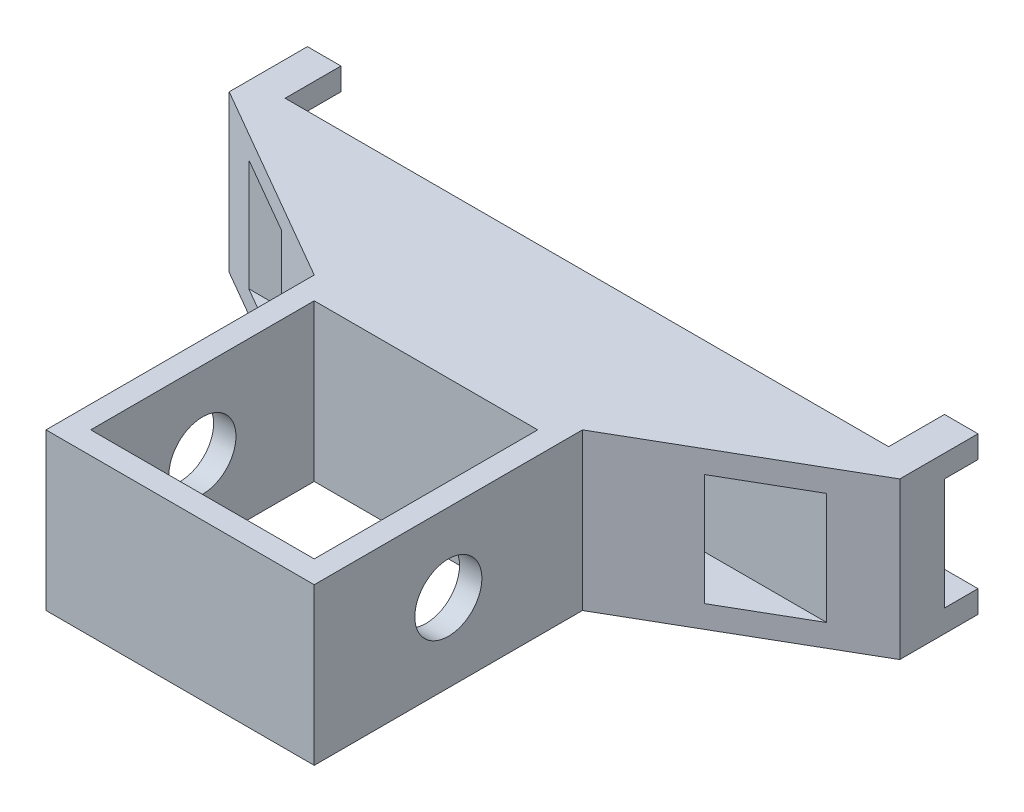
ISO-10303-21;
HEADER;
FILE_DESCRIPTION(('STEP AP214'),'2;1');
FILE_NAME('part.step','',(''),(''),'','','');
FILE_SCHEMA(('AUTOMOTIVE_DESIGN { 1 0 10303 214 1 1 1 1 }'));
ENDSEC;
DATA;
#1=APPLICATION_CONTEXT('core data for automotive mechanical design processes');
#2=APPLICATION_PROTOCOL_DEFINITION('international standard','automotive_design',2000,#1);
#3=PRODUCT_CONTEXT('',#1,'mechanical');
#4=PRODUCT('Part','Part','',(#3));
#5=PRODUCT_RELATED_PRODUCT_CATEGORY('part','',(#4));
#6=PRODUCT_DEFINITION_FORMATION('','',#4);
#7=PRODUCT_DEFINITION_CONTEXT('part definition',#1,'design');
#8=PRODUCT_DEFINITION('design','',#6,#7);
#9=PRODUCT_DEFINITION_SHAPE('','',#8);
#10=(LENGTH_UNIT() NAMED_UNIT(*) SI_UNIT(.MILLI.,.METRE.));
#11=(NAMED_UNIT(*) PLANE_ANGLE_UNIT() SI_UNIT($,.RADIAN.));
#12=(NAMED_UNIT(*) SI_UNIT($,.STERADIAN.) SOLID_ANGLE_UNIT());
#13=UNCERTAINTY_MEASURE_WITH_UNIT(LENGTH_MEASURE(1.E-05),#10,'distance_accuracy_value','');
#14=(GEOMETRIC_REPRESENTATION_CONTEXT(3) GLOBAL_UNCERTAINTY_ASSIGNED_CONTEXT((#13)) GLOBAL_UNIT_ASSIGNED_CONTEXT((#10,
#11,#12)) REPRESENTATION_CONTEXT('',''));
#15=CARTESIAN_POINT('',(0.,0.,0.));
#16=DIRECTION('',(0.,0.,1.));
#17=DIRECTION('',(1.,0.,0.));
#18=AXIS2_PLACEMENT_3D('',#15,#16,#17);
#19=CARTESIAN_POINT('',(0.,7.,-20.6961524227066));
#20=DIRECTION('',(0.,0.,-1.));
#21=DIRECTION('',(-1.,0.,0.));
#22=AXIS2_PLACEMENT_3D('',#19,#20,#21);
#23=PLANE('',#22);
#24=DIRECTION('',(-1.,0.,0.));
#25=VECTOR('',#24,1.);
#26=CARTESIAN_POINT('',(15.,6.,-20.6961524227066));
#27=LINE('',#26,#25);
#28=CARTESIAN_POINT('',(15.,6.,-20.6961524227066));
#29=VERTEX_POINT('',#28);
#30=CARTESIAN_POINT('',(13.5,6.,-20.6961524227066));
#31=VERTEX_POINT('',#30);
#32=EDGE_CURVE('E311',#29,#31,#27,.T.);
#33=ORIENTED_EDGE('',*,*,#32,.T.);
#34=DIRECTION('',(0.,-1.,0.));
#35=VECTOR('',#34,1.);
#36=CARTESIAN_POINT('',(13.5,7.,-20.6961524227066));
#37=LINE('',#36,#35);
#38=CARTESIAN_POINT('',(13.5,7.,-20.6961524227066));
#39=VERTEX_POINT('',#38);
#40=EDGE_CURVE('E360',#39,#31,#37,.T.);
#41=ORIENTED_EDGE('',*,*,#40,.F.);
#42=DIRECTION('',(1.,0.,0.));
#43=VECTOR('',#42,1.);
#44=CARTESIAN_POINT('',(0.,7.,-20.6961524227066));
#45=LINE('',#44,#43);
#46=CARTESIAN_POINT('',(15.,7.,-20.6961524227066));
#47=VERTEX_POINT('',#46);
#48=EDGE_CURVE('E414',#39,#47,#45,.T.);
#49=ORIENTED_EDGE('',*,*,#48,.T.);
#50=DIRECTION('',(0.,-1.,0.));
#51=VECTOR('',#50,1.);
#52=CARTESIAN_POINT('',(15.,7.,-20.6961524227066));
#53=LINE('',#52,#51);
#54=EDGE_CURVE('E247',#47,#29,#53,.T.);
#55=ORIENTED_EDGE('',*,*,#54,.T.);
#56=EDGE_LOOP('',(#33,#41,#49,#55));
#57=FACE_BOUND('',#56,.T.);
#58=ADVANCED_FACE('F39',(#57),#23,.T.);
#59=CARTESIAN_POINT('',(-13.5,6.,-20.6961524227066));
#60=VERTEX_POINT('',#59);
#61=CARTESIAN_POINT('',(-15.,6.,-20.6961524227066));
#62=VERTEX_POINT('',#61);
#63=EDGE_CURVE('E308',#60,#62,#27,.T.);
#64=ORIENTED_EDGE('',*,*,#63,.T.);
#65=DIRECTION('',(0.,-1.,0.));
#66=VECTOR('',#65,1.);
#67=CARTESIAN_POINT('',(-15.,7.,-20.6961524227066));
#68=LINE('',#67,#66);
#69=CARTESIAN_POINT('',(-15.,7.,-20.6961524227066));
#70=VERTEX_POINT('',#69);
#71=EDGE_CURVE('E272',#70,#62,#68,.T.);
#72=ORIENTED_EDGE('',*,*,#71,.F.);
#73=CARTESIAN_POINT('',(-13.5,7.,-20.6961524227067));
#74=VERTEX_POINT('',#73);
#75=EDGE_CURVE('E410',#70,#74,#45,.T.);
#76=ORIENTED_EDGE('',*,*,#75,.T.);
#77=DIRECTION('',(0.,-1.,0.));
#78=VECTOR('',#77,1.);
#79=CARTESIAN_POINT('',(-13.5,7.,-20.6961524227067));
#80=LINE('',#79,#78);
#81=EDGE_CURVE('E363',#74,#60,#80,.T.);
#82=ORIENTED_EDGE('',*,*,#81,.T.);
#83=EDGE_LOOP('',(#64,#72,#76,#82));
#84=FACE_BOUND('',#83,.T.);
#85=ADVANCED_FACE('F509',(#84),#23,.T.);
#86=DIRECTION('',(-1.,0.,0.));
#87=VECTOR('',#86,1.);
#88=CARTESIAN_POINT('',(15.,1.,-20.6961524227066));
#89=LINE('',#88,#87);
#90=CARTESIAN_POINT('',(15.,1.,-20.6961524227066));
#91=VERTEX_POINT('',#90);
#92=CARTESIAN_POINT('',(13.5,1.,-20.6961524227066));
#93=VERTEX_POINT('',#92);
#94=EDGE_CURVE('E54',#91,#93,#89,.T.);
#95=ORIENTED_EDGE('',*,*,#94,.F.);
#96=CARTESIAN_POINT('',(15.,0.,-20.6961524227066));
#97=VERTEX_POINT('',#96);
#98=EDGE_CURVE('E237',#91,#97,#53,.T.);
#99=ORIENTED_EDGE('',*,*,#98,.T.);
#100=DIRECTION('',(1.,0.,0.));
#101=VECTOR('',#100,1.);
#102=CARTESIAN_POINT('',(0.,0.,-20.6961524227066));
#103=LINE('',#102,#101);
#104=CARTESIAN_POINT('',(13.5,0.,-20.6961524227066));
#105=VERTEX_POINT('',#104);
#106=EDGE_CURVE('E403',#105,#97,#103,.T.);
#107=ORIENTED_EDGE('',*,*,#106,.F.);
#108=EDGE_CURVE('E239',#93,#105,#37,.T.);
#109=ORIENTED_EDGE('',*,*,#108,.F.);
#110=EDGE_LOOP('',(#95,#99,#107,#109));
#111=FACE_BOUND('',#110,.T.);
#112=ADVANCED_FACE('F235',(#111),#23,.T.);
#113=CARTESIAN_POINT('',(-13.5,1.,-20.6961524227066));
#114=VERTEX_POINT('',#113);
#115=CARTESIAN_POINT('',(-15.,1.,-20.6961524227066));
#116=VERTEX_POINT('',#115);
#117=EDGE_CURVE('E240',#114,#116,#89,.T.);
#118=ORIENTED_EDGE('',*,*,#117,.F.);
#119=CARTESIAN_POINT('',(-13.5,0.,-20.6961524227067));
#120=VERTEX_POINT('',#119);
#121=EDGE_CURVE('E365',#114,#120,#80,.T.);
#122=ORIENTED_EDGE('',*,*,#121,.T.);
#123=CARTESIAN_POINT('',(-15.,0.,-20.6961524227066));
#124=VERTEX_POINT('',#123);
#125=EDGE_CURVE('E428',#124,#120,#103,.T.);
#126=ORIENTED_EDGE('',*,*,#125,.F.);
#127=EDGE_CURVE('E271',#116,#124,#68,.T.);
#128=ORIENTED_EDGE('',*,*,#127,.F.);
#129=EDGE_LOOP('',(#118,#122,#126,#128));
#130=FACE_BOUND('',#129,.T.);
#131=ADVANCED_FACE('F41',(#130),#23,.T.);
#132=CARTESIAN_POINT('',(-15.,7.,0.));
#133=DIRECTION('',(-1.,0.,0.));
#134=DIRECTION('',(0.,0.,1.));
#135=AXIS2_PLACEMENT_3D('',#132,#133,#134);
#136=PLANE('',#135);
#137=DIRECTION('',(0.,0.,-1.));
#138=VECTOR('',#137,1.);
#139=CARTESIAN_POINT('',(-15.,6.,-20.6961524227066));
#140=LINE('',#139,#138);
#141=CARTESIAN_POINT('',(-15.,6.,-19.1961524227066));
#142=VERTEX_POINT('',#141);
#143=EDGE_CURVE('E231',#142,#62,#140,.T.);
#144=ORIENTED_EDGE('',*,*,#143,.F.);
#145=DIRECTION('',(0.,1.,0.));
#146=VECTOR('',#145,1.);
#147=CARTESIAN_POINT('',(-15.,6.,-19.1961524227066));
#148=LINE('',#147,#146);
#149=CARTESIAN_POINT('',(-15.,1.,-19.1961524227066));
#150=VERTEX_POINT('',#149);
#151=EDGE_CURVE('E302',#150,#142,#148,.T.);
#152=ORIENTED_EDGE('',*,*,#151,.F.);
#153=DIRECTION('',(0.,0.,1.));
#154=VECTOR('',#153,1.);
#155=CARTESIAN_POINT('',(-15.,1.,-20.6961524227066));
#156=LINE('',#155,#154);
#157=EDGE_CURVE('E490',#116,#150,#156,.T.);
#158=ORIENTED_EDGE('',*,*,#157,.F.);
#159=ORIENTED_EDGE('',*,*,#127,.T.);
#160=DIRECTION('',(0.,0.,-1.));
#161=VECTOR('',#160,1.);
#162=CARTESIAN_POINT('',(-15.,0.,0.));
#163=LINE('',#162,#161);
#164=CARTESIAN_POINT('',(-15.,0.,-17.1961524227066));
#165=VERTEX_POINT('',#164);
#166=EDGE_CURVE('E431',#165,#124,#163,.T.);
#167=ORIENTED_EDGE('',*,*,#166,.F.);
#168=DIRECTION('',(0.,-1.,0.));
#169=VECTOR('',#168,1.);
#170=CARTESIAN_POINT('',(-15.,7.,-17.1961524227066));
#171=LINE('',#170,#169);
#172=CARTESIAN_POINT('',(-15.,7.,-17.1961524227066));
#173=VERTEX_POINT('',#172);
#174=EDGE_CURVE('E269',#173,#165,#171,.T.);
#175=ORIENTED_EDGE('',*,*,#174,.F.);
#176=DIRECTION('',(0.,0.,-1.));
#177=VECTOR('',#176,1.);
#178=CARTESIAN_POINT('',(-15.,7.,0.));
#179=LINE('',#178,#177);
#180=EDGE_CURVE('E413',#173,#70,#179,.T.);
#181=ORIENTED_EDGE('',*,*,#180,.T.);
#182=ORIENTED_EDGE('',*,*,#71,.T.);
#183=EDGE_LOOP('',(#144,#152,#158,#159,#167,#175,#181,#182));
#184=FACE_BOUND('',#183,.T.);
#185=ADVANCED_FACE('F486',(#184),#136,.T.);
#186=CARTESIAN_POINT('',(3.69615242270663,7.,-6.40192378864667));
#187=DIRECTION('',(-0.500000000000001,0.,0.866025403784438));
#188=DIRECTION('',(0.866025403784438,0.,0.500000000000001));
#189=AXIS2_PLACEMENT_3D('',#186,#187,#188);
#190=PLANE('',#189);
#191=DIRECTION('',(0.,1.,0.));
#192=VECTOR('',#191,1.);
#193=CARTESIAN_POINT('',(-9.46410161513763,7.,-13.9999999999999));
#194=LINE('',#193,#192);
#195=CARTESIAN_POINT('',(-9.46410161513764,1.,-13.9999999999999));
#196=VERTEX_POINT('',#195);
#197=CARTESIAN_POINT('',(-9.46410161513764,6.,-13.9999999999999));
#198=VERTEX_POINT('',#197);
#199=EDGE_CURVE('E340',#196,#198,#194,.T.);
#200=ORIENTED_EDGE('',*,*,#199,.F.);
#201=DIRECTION('',(0.866025403784438,0.,0.500000000000001));
#202=VECTOR('',#201,1.);
#203=CARTESIAN_POINT('',(3.69615242270663,1.,-6.40192378864667));
#204=LINE('',#203,#202);
#205=CARTESIAN_POINT('',(-12.9282032302755,1.,-16.));
#206=VERTEX_POINT('',#205);
#207=EDGE_CURVE('E326',#206,#196,#204,.T.);
#208=ORIENTED_EDGE('',*,*,#207,.F.);
#209=DIRECTION('',(0.,-1.,0.));
#210=VECTOR('',#209,1.);
#211=CARTESIAN_POINT('',(-12.9282032302754,7.,-15.9999999999999));
#212=LINE('',#211,#210);
#213=CARTESIAN_POINT('',(-12.9282032302754,6.,-15.9999999999999));
#214=VERTEX_POINT('',#213);
#215=EDGE_CURVE('E335',#214,#206,#212,.T.);
#216=ORIENTED_EDGE('',*,*,#215,.F.);
#217=DIRECTION('',(-0.866025403784438,0.,-0.500000000000001));
#218=VECTOR('',#217,1.);
#219=CARTESIAN_POINT('',(3.69615242270663,6.,-6.40192378864667));
#220=LINE('',#219,#218);
#221=EDGE_CURVE('E338',#198,#214,#220,.T.);
#222=ORIENTED_EDGE('',*,*,#221,.F.);
#223=EDGE_LOOP('',(#200,#208,#216,#222));
#224=FACE_BOUND('',#223,.T.);
#225=DIRECTION('',(-0.866025403784438,0.,-0.500000000000001));
#226=VECTOR('',#225,1.);
#227=CARTESIAN_POINT('',(3.69615242270663,0.,-6.40192378864667));
#228=LINE('',#227,#226);
#229=CARTESIAN_POINT('',(-6.,0.,-12.));
#230=VERTEX_POINT('',#229);
#231=EDGE_CURVE('E434',#230,#165,#228,.T.);
#232=ORIENTED_EDGE('',*,*,#231,.F.);
#233=DIRECTION('',(0.,-1.,0.));
#234=VECTOR('',#233,1.);
#235=CARTESIAN_POINT('',(-6.,7.,-12.));
#236=LINE('',#235,#234);
#237=CARTESIAN_POINT('',(-6.,7.,-12.));
#238=VERTEX_POINT('',#237);
#239=EDGE_CURVE('E267',#238,#230,#236,.T.);
#240=ORIENTED_EDGE('',*,*,#239,.F.);
#241=DIRECTION('',(-0.866025403784438,0.,-0.500000000000001));
#242=VECTOR('',#241,1.);
#243=CARTESIAN_POINT('',(3.69615242270663,7.,-6.40192378864667));
#244=LINE('',#243,#242);
#245=EDGE_CURVE('E417',#238,#173,#244,.T.);
#246=ORIENTED_EDGE('',*,*,#245,.T.);
#247=ORIENTED_EDGE('',*,*,#174,.T.);
#248=EDGE_LOOP('',(#232,#240,#246,#247));
#249=FACE_BOUND('',#248,.T.);
#250=ADVANCED_FACE('F481',(#224,#249),#190,.T.);
#251=CARTESIAN_POINT('',(-6.,7.,0.));
#252=DIRECTION('',(1.,0.,0.));
#253=DIRECTION('',(0.,0.,-1.));
#254=AXIS2_PLACEMENT_3D('',#251,#252,#253);
#255=PLANE('',#254);
#256=CARTESIAN_POINT('',(-6.,3.5,-6.));
#257=DIRECTION('',(-1.,0.,0.));
#258=DIRECTION('',(0.,0.,1.));
#259=AXIS2_PLACEMENT_3D('',#256,#257,#258);
#260=CIRCLE('',#259,1.5);
#261=CARTESIAN_POINT('',(-6.,3.5,-4.5));
#262=VERTEX_POINT('',#261);
#263=EDGE_CURVE('E280',#262,#262,#260,.T.);
#264=ORIENTED_EDGE('',*,*,#263,.F.);
#265=EDGE_LOOP('',(#264));
#266=FACE_BOUND('',#265,.T.);
#267=DIRECTION('',(0.,0.,1.));
#268=VECTOR('',#267,1.);
#269=CARTESIAN_POINT('',(-6.,0.,0.));
#270=LINE('',#269,#268);
#271=CARTESIAN_POINT('',(-6.,0.,0.));
#272=VERTEX_POINT('',#271);
#273=EDGE_CURVE('E437',#230,#272,#270,.T.);
#274=ORIENTED_EDGE('',*,*,#273,.T.);
#275=DIRECTION('',(0.,-1.,0.));
#276=VECTOR('',#275,1.);
#277=CARTESIAN_POINT('',(-6.,7.,0.));
#278=LINE('',#277,#276);
#279=CARTESIAN_POINT('',(-6.,7.,0.));
#280=VERTEX_POINT('',#279);
#281=EDGE_CURVE('E264',#280,#272,#278,.T.);
#282=ORIENTED_EDGE('',*,*,#281,.F.);
#283=DIRECTION('',(0.,0.,1.));
#284=VECTOR('',#283,1.);
#285=CARTESIAN_POINT('',(-6.,7.,0.));
#286=LINE('',#285,#284);
#287=EDGE_CURVE('E420',#238,#280,#286,.T.);
#288=ORIENTED_EDGE('',*,*,#287,.F.);
#289=ORIENTED_EDGE('',*,*,#239,.T.);
#290=EDGE_LOOP('',(#274,#282,#288,#289));
#291=FACE_BOUND('',#290,.T.);
#292=ADVANCED_FACE('F478',(#266,#291),#255,.F.);
#293=CARTESIAN_POINT('',(0.,7.,0.));
#294=DIRECTION('',(0.,0.,-1.));
#295=DIRECTION('',(-1.,0.,0.));
#296=AXIS2_PLACEMENT_3D('',#293,#294,#295);
#297=PLANE('',#296);
#298=DIRECTION('',(1.,0.,0.));
#299=VECTOR('',#298,1.);
#300=CARTESIAN_POINT('',(0.,0.,0.));
#301=LINE('',#300,#299);
#302=CARTESIAN_POINT('',(6.,0.,0.));
#303=VERTEX_POINT('',#302);
#304=EDGE_CURVE('E439',#272,#303,#301,.T.);
#305=ORIENTED_EDGE('',*,*,#304,.T.);
#306=DIRECTION('',(0.,-1.,0.));
#307=VECTOR('',#306,1.);
#308=CARTESIAN_POINT('',(6.,7.,0.));
#309=LINE('',#308,#307);
#310=CARTESIAN_POINT('',(6.,7.,0.));
#311=VERTEX_POINT('',#310);
#312=EDGE_CURVE('E261',#311,#303,#309,.T.);
#313=ORIENTED_EDGE('',*,*,#312,.F.);
#314=DIRECTION('',(1.,0.,0.));
#315=VECTOR('',#314,1.);
#316=CARTESIAN_POINT('',(0.,7.,0.));
#317=LINE('',#316,#315);
#318=EDGE_CURVE('E422',#280,#311,#317,.T.);
#319=ORIENTED_EDGE('',*,*,#318,.F.);
#320=ORIENTED_EDGE('',*,*,#281,.T.);
#321=EDGE_LOOP('',(#305,#313,#319,#320));
#322=FACE_BOUND('',#321,.T.);
#323=ADVANCED_FACE('F473',(#322),#297,.F.);
#324=CARTESIAN_POINT('',(6.,7.,0.));
#325=DIRECTION('',(-1.,0.,0.));
#326=DIRECTION('',(0.,0.,1.));
#327=AXIS2_PLACEMENT_3D('',#324,#325,#326);
#328=PLANE('',#327);
#329=CARTESIAN_POINT('',(6.,3.5,-6.));
#330=DIRECTION('',(-1.,0.,0.));
#331=DIRECTION('',(0.,0.,1.));
#332=AXIS2_PLACEMENT_3D('',#329,#330,#331);
#333=CIRCLE('',#332,1.5);
#334=CARTESIAN_POINT('',(6.,3.5,-4.5));
#335=VERTEX_POINT('',#334);
#336=EDGE_CURVE('E374',#335,#335,#333,.T.);
#337=ORIENTED_EDGE('',*,*,#336,.T.);
#338=EDGE_LOOP('',(#337));
#339=FACE_BOUND('',#338,.T.);
#340=DIRECTION('',(0.,0.,-1.));
#341=VECTOR('',#340,1.);
#342=CARTESIAN_POINT('',(6.,0.,0.));
#343=LINE('',#342,#341);
#344=CARTESIAN_POINT('',(6.,0.,-12.));
#345=VERTEX_POINT('',#344);
#346=EDGE_CURVE('E441',#303,#345,#343,.T.);
#347=ORIENTED_EDGE('',*,*,#346,.T.);
#348=DIRECTION('',(0.,-1.,0.));
#349=VECTOR('',#348,1.);
#350=CARTESIAN_POINT('',(6.,7.,-12.));
#351=LINE('',#350,#349);
#352=CARTESIAN_POINT('',(6.,7.,-12.));
#353=VERTEX_POINT('',#352);
#354=EDGE_CURVE('E259',#353,#345,#351,.T.);
#355=ORIENTED_EDGE('',*,*,#354,.F.);
#356=DIRECTION('',(0.,0.,-1.));
#357=VECTOR('',#356,1.);
#358=CARTESIAN_POINT('',(6.,7.,0.));
#359=LINE('',#358,#357);
#360=EDGE_CURVE('E424',#311,#353,#359,.T.);
#361=ORIENTED_EDGE('',*,*,#360,.F.);
#362=ORIENTED_EDGE('',*,*,#312,.T.);
#363=EDGE_LOOP('',(#347,#355,#361,#362));
#364=FACE_BOUND('',#363,.T.);
#365=ADVANCED_FACE('F465',(#339,#364),#328,.F.);
#366=CARTESIAN_POINT('',(-3.69615242270663,7.,-6.40192378864667));
#367=DIRECTION('',(0.500000000000001,0.,0.866025403784438));
#368=DIRECTION('',(0.866025403784438,0.,-0.500000000000001));
#369=AXIS2_PLACEMENT_3D('',#366,#367,#368);
#370=PLANE('',#369);
#371=DIRECTION('',(0.,-1.,0.));
#372=VECTOR('',#371,1.);
#373=CARTESIAN_POINT('',(9.46410161513777,7.,-14.));
#374=LINE('',#373,#372);
#375=CARTESIAN_POINT('',(9.46410161513777,6.,-14.));
#376=VERTEX_POINT('',#375);
#377=CARTESIAN_POINT('',(9.4641016151376,1.,-13.9999999999999));
#378=VERTEX_POINT('',#377);
#379=EDGE_CURVE('E286',#376,#378,#374,.T.);
#380=ORIENTED_EDGE('',*,*,#379,.F.);
#381=DIRECTION('',(-0.866025403784438,0.,0.500000000000001));
#382=VECTOR('',#381,1.);
#383=CARTESIAN_POINT('',(-3.69615242270663,6.,-6.40192378864667));
#384=LINE('',#383,#382);
#385=CARTESIAN_POINT('',(12.9282032302755,6.,-16.));
#386=VERTEX_POINT('',#385);
#387=EDGE_CURVE('E284',#386,#376,#384,.T.);
#388=ORIENTED_EDGE('',*,*,#387,.F.);
#389=DIRECTION('',(0.,1.,0.));
#390=VECTOR('',#389,1.);
#391=CARTESIAN_POINT('',(12.9282032302755,7.,-16.));
#392=LINE('',#391,#390);
#393=CARTESIAN_POINT('',(12.9282032302755,1.,-16.));
#394=VERTEX_POINT('',#393);
#395=EDGE_CURVE('E282',#394,#386,#392,.T.);
#396=ORIENTED_EDGE('',*,*,#395,.F.);
#397=DIRECTION('',(0.866025403784438,0.,-0.500000000000001));
#398=VECTOR('',#397,1.);
#399=CARTESIAN_POINT('',(-3.69615242270663,1.,-6.40192378864667));
#400=LINE('',#399,#398);
#401=EDGE_CURVE('E275',#378,#394,#400,.T.);
#402=ORIENTED_EDGE('',*,*,#401,.F.);
#403=EDGE_LOOP('',(#380,#388,#396,#402));
#404=FACE_BOUND('',#403,.T.);
#405=DIRECTION('',(-0.866025403784438,0.,0.500000000000001));
#406=VECTOR('',#405,1.);
#407=CARTESIAN_POINT('',(-3.69615242270663,0.,-6.40192378864667));
#408=LINE('',#407,#406);
#409=CARTESIAN_POINT('',(15.,0.,-17.1961524227066));
#410=VERTEX_POINT('',#409);
#411=EDGE_CURVE('E443',#410,#345,#408,.T.);
#412=ORIENTED_EDGE('',*,*,#411,.F.);
#413=DIRECTION('',(0.,-1.,0.));
#414=VECTOR('',#413,1.);
#415=CARTESIAN_POINT('',(15.,7.,-17.1961524227066));
#416=LINE('',#415,#414);
#417=CARTESIAN_POINT('',(15.,7.,-17.1961524227066));
#418=VERTEX_POINT('',#417);
#419=EDGE_CURVE('E251',#418,#410,#416,.T.);
#420=ORIENTED_EDGE('',*,*,#419,.F.);
#421=DIRECTION('',(-0.866025403784438,0.,0.500000000000001));
#422=VECTOR('',#421,1.);
#423=CARTESIAN_POINT('',(-3.69615242270663,7.,-6.40192378864667));
#424=LINE('',#423,#422);
#425=EDGE_CURVE('E253',#418,#353,#424,.T.);
#426=ORIENTED_EDGE('',*,*,#425,.T.);
#427=ORIENTED_EDGE('',*,*,#354,.T.);
#428=EDGE_LOOP('',(#412,#420,#426,#427));
#429=FACE_BOUND('',#428,.T.);
#430=ADVANCED_FACE('F463',(#404,#429),#370,.T.);
#431=CARTESIAN_POINT('',(15.0000000000001,7.,0.));
#432=DIRECTION('',(1.,0.,0.));
#433=DIRECTION('',(0.,0.,-1.));
#434=AXIS2_PLACEMENT_3D('',#431,#432,#433);
#435=PLANE('',#434);
#436=DIRECTION('',(0.,0.,-1.));
#437=VECTOR('',#436,1.);
#438=CARTESIAN_POINT('',(15.,6.,-20.6961524227066));
#439=LINE('',#438,#437);
#440=CARTESIAN_POINT('',(15.,6.,-19.1961524227066));
#441=VERTEX_POINT('',#440);
#442=EDGE_CURVE('E456',#441,#29,#439,.T.);
#443=ORIENTED_EDGE('',*,*,#442,.T.);
#444=ORIENTED_EDGE('',*,*,#54,.F.);
#445=DIRECTION('',(0.,0.,1.));
#446=VECTOR('',#445,1.);
#447=CARTESIAN_POINT('',(15.0000000000001,7.,0.));
#448=LINE('',#447,#446);
#449=EDGE_CURVE('E248',#47,#418,#448,.T.);
#450=ORIENTED_EDGE('',*,*,#449,.T.);
#451=ORIENTED_EDGE('',*,*,#419,.T.);
#452=DIRECTION('',(0.,0.,1.));
#453=VECTOR('',#452,1.);
#454=CARTESIAN_POINT('',(15.0000000000001,0.,0.));
#455=LINE('',#454,#453);
#456=EDGE_CURVE('E246',#97,#410,#455,.T.);
#457=ORIENTED_EDGE('',*,*,#456,.F.);
#458=ORIENTED_EDGE('',*,*,#98,.F.);
#459=DIRECTION('',(0.,0.,1.));
#460=VECTOR('',#459,1.);
#461=CARTESIAN_POINT('',(15.,1.,-20.6961524227066));
#462=LINE('',#461,#460);
#463=CARTESIAN_POINT('',(15.,1.,-19.1961524227066));
#464=VERTEX_POINT('',#463);
#465=EDGE_CURVE('E222',#91,#464,#462,.T.);
#466=ORIENTED_EDGE('',*,*,#465,.T.);
#467=DIRECTION('',(0.,1.,0.));
#468=VECTOR('',#467,1.);
#469=CARTESIAN_POINT('',(15.,6.,-19.1961524227066));
#470=LINE('',#469,#468);
#471=EDGE_CURVE('E230',#464,#441,#470,.T.);
#472=ORIENTED_EDGE('',*,*,#471,.T.);
#473=EDGE_LOOP('',(#443,#444,#450,#451,#457,#458,#466,#472));
#474=FACE_BOUND('',#473,.T.);
#475=ADVANCED_FACE('F244',(#474),#435,.T.);
#476=CARTESIAN_POINT('',(0.,7.,0.));
#477=DIRECTION('',(0.,1.,0.));
#478=DIRECTION('',(0.,0.,1.));
#479=AXIS2_PLACEMENT_3D('',#476,#477,#478);
#480=PLANE('',#479);
#481=DIRECTION('',(0.,0.,1.));
#482=VECTOR('',#481,1.);
#483=CARTESIAN_POINT('',(13.5,7.,-20.6961524227066));
#484=LINE('',#483,#482);
#485=CARTESIAN_POINT('',(13.5,7.,-18.1961524227066));
#486=VERTEX_POINT('',#485);
#487=EDGE_CURVE('E343',#39,#486,#484,.T.);
#488=ORIENTED_EDGE('',*,*,#487,.T.);
#489=DIRECTION('',(-1.,0.,0.));
#490=VECTOR('',#489,1.);
#491=CARTESIAN_POINT('',(13.5,7.,-18.1961524227066));
#492=LINE('',#491,#490);
#493=CARTESIAN_POINT('',(-13.5,7.,-18.1961524227067));
#494=VERTEX_POINT('',#493);
#495=EDGE_CURVE('E346',#486,#494,#492,.T.);
#496=ORIENTED_EDGE('',*,*,#495,.T.);
#497=DIRECTION('',(0.,0.,-1.));
#498=VECTOR('',#497,1.);
#499=CARTESIAN_POINT('',(-13.5,7.,-20.6961524227067));
#500=LINE('',#499,#498);
#501=EDGE_CURVE('E350',#494,#74,#500,.T.);
#502=ORIENTED_EDGE('',*,*,#501,.T.);
#503=ORIENTED_EDGE('',*,*,#75,.F.);
#504=ORIENTED_EDGE('',*,*,#180,.F.);
#505=ORIENTED_EDGE('',*,*,#245,.F.);
#506=ORIENTED_EDGE('',*,*,#287,.T.);
#507=ORIENTED_EDGE('',*,*,#318,.T.);
#508=ORIENTED_EDGE('',*,*,#360,.T.);
#509=ORIENTED_EDGE('',*,*,#425,.F.);
#510=ORIENTED_EDGE('',*,*,#449,.F.);
#511=ORIENTED_EDGE('',*,*,#48,.F.);
#512=EDGE_LOOP('',(#488,#496,#502,#503,#504,#505,#506,#507,#508,#509,#510,#511));
#513=FACE_BOUND('',#512,.T.);
#514=DIRECTION('',(0.,0.,1.));
#515=VECTOR('',#514,1.);
#516=CARTESIAN_POINT('',(-5.,7.,-1.));
#517=LINE('',#516,#515);
#518=CARTESIAN_POINT('',(-5.,7.,-11.));
#519=VERTEX_POINT('',#518);
#520=CARTESIAN_POINT('',(-5.,7.,-1.));
#521=VERTEX_POINT('',#520);
#522=EDGE_CURVE('E377',#519,#521,#517,.T.);
#523=ORIENTED_EDGE('',*,*,#522,.F.);
#524=DIRECTION('',(-1.,0.,0.));
#525=VECTOR('',#524,1.);
#526=CARTESIAN_POINT('',(-5.,7.,-11.));
#527=LINE('',#526,#525);
#528=CARTESIAN_POINT('',(5.,7.,-11.));
#529=VERTEX_POINT('',#528);
#530=EDGE_CURVE('E382',#529,#519,#527,.T.);
#531=ORIENTED_EDGE('',*,*,#530,.F.);
#532=DIRECTION('',(0.,0.,-1.));
#533=VECTOR('',#532,1.);
#534=CARTESIAN_POINT('',(5.,7.,-1.));
#535=LINE('',#534,#533);
#536=CARTESIAN_POINT('',(5.,7.,-1.));
#537=VERTEX_POINT('',#536);
#538=EDGE_CURVE('E396',#537,#529,#535,.T.);
#539=ORIENTED_EDGE('',*,*,#538,.F.);
#540=DIRECTION('',(1.,0.,0.));
#541=VECTOR('',#540,1.);
#542=CARTESIAN_POINT('',(-5.,7.,-1.));
#543=LINE('',#542,#541);
#544=EDGE_CURVE('E393',#521,#537,#543,.T.);
#545=ORIENTED_EDGE('',*,*,#544,.F.);
#546=EDGE_LOOP('',(#523,#531,#539,#545));
#547=FACE_BOUND('',#546,.T.);
#548=ADVANCED_FACE('F458',(#513,#547),#480,.T.);
#549=CARTESIAN_POINT('',(0.,0.,0.));
#550=DIRECTION('',(0.,1.,0.));
#551=DIRECTION('',(0.,0.,1.));
#552=AXIS2_PLACEMENT_3D('',#549,#550,#551);
#553=PLANE('',#552);
#554=DIRECTION('',(-1.,0.,0.));
#555=VECTOR('',#554,1.);
#556=CARTESIAN_POINT('',(-5.,0.,-11.));
#557=LINE('',#556,#555);
#558=CARTESIAN_POINT('',(5.,0.,-11.));
#559=VERTEX_POINT('',#558);
#560=CARTESIAN_POINT('',(-5.,0.,-11.));
#561=VERTEX_POINT('',#560);
#562=EDGE_CURVE('E388',#559,#561,#557,.T.);
#563=ORIENTED_EDGE('',*,*,#562,.T.);
#564=DIRECTION('',(0.,0.,1.));
#565=VECTOR('',#564,1.);
#566=CARTESIAN_POINT('',(-5.,0.,-1.));
#567=LINE('',#566,#565);
#568=CARTESIAN_POINT('',(-5.,0.,-1.));
#569=VERTEX_POINT('',#568);
#570=EDGE_CURVE('E378',#561,#569,#567,.T.);
#571=ORIENTED_EDGE('',*,*,#570,.T.);
#572=DIRECTION('',(1.,0.,0.));
#573=VECTOR('',#572,1.);
#574=CARTESIAN_POINT('',(-5.,0.,-1.));
#575=LINE('',#574,#573);
#576=CARTESIAN_POINT('',(5.,0.,-1.));
#577=VERTEX_POINT('',#576);
#578=EDGE_CURVE('E381',#569,#577,#575,.T.);
#579=ORIENTED_EDGE('',*,*,#578,.T.);
#580=DIRECTION('',(0.,0.,-1.));
#581=VECTOR('',#580,1.);
#582=CARTESIAN_POINT('',(5.,0.,-1.));
#583=LINE('',#582,#581);
#584=EDGE_CURVE('E385',#577,#559,#583,.T.);
#585=ORIENTED_EDGE('',*,*,#584,.T.);
#586=EDGE_LOOP('',(#563,#571,#579,#585));
#587=FACE_BOUND('',#586,.T.);
#588=DIRECTION('',(-1.,0.,0.));
#589=VECTOR('',#588,1.);
#590=CARTESIAN_POINT('',(13.5,0.,-18.1961524227066));
#591=LINE('',#590,#589);
#592=CARTESIAN_POINT('',(13.5,0.,-18.1961524227066));
#593=VERTEX_POINT('',#592);
#594=CARTESIAN_POINT('',(-13.5,0.,-18.1961524227067));
#595=VERTEX_POINT('',#594);
#596=EDGE_CURVE('E355',#593,#595,#591,.T.);
#597=ORIENTED_EDGE('',*,*,#596,.F.);
#598=DIRECTION('',(0.,0.,1.));
#599=VECTOR('',#598,1.);
#600=CARTESIAN_POINT('',(13.5,0.,-20.6961524227066));
#601=LINE('',#600,#599);
#602=EDGE_CURVE('E342',#105,#593,#601,.T.);
#603=ORIENTED_EDGE('',*,*,#602,.F.);
#604=ORIENTED_EDGE('',*,*,#106,.T.);
#605=ORIENTED_EDGE('',*,*,#456,.T.);
#606=ORIENTED_EDGE('',*,*,#411,.T.);
#607=ORIENTED_EDGE('',*,*,#346,.F.);
#608=ORIENTED_EDGE('',*,*,#304,.F.);
#609=ORIENTED_EDGE('',*,*,#273,.F.);
#610=ORIENTED_EDGE('',*,*,#231,.T.);
#611=ORIENTED_EDGE('',*,*,#166,.T.);
#612=ORIENTED_EDGE('',*,*,#125,.T.);
#613=DIRECTION('',(0.,0.,-1.));
#614=VECTOR('',#613,1.);
#615=CARTESIAN_POINT('',(-13.5,0.,-20.6961524227067));
#616=LINE('',#615,#614);
#617=EDGE_CURVE('E347',#595,#120,#616,.T.);
#618=ORIENTED_EDGE('',*,*,#617,.F.);
#619=EDGE_LOOP('',(#597,#603,#604,#605,#606,#607,#608,#609,#610,#611,#612,#618));
#620=FACE_BOUND('',#619,.T.);
#621=ADVANCED_FACE('F469',(#587,#620),#553,.F.);
#622=CARTESIAN_POINT('',(-5.,0.,-1.));
#623=DIRECTION('',(-1.,0.,0.));
#624=DIRECTION('',(0.,0.,1.));
#625=AXIS2_PLACEMENT_3D('',#622,#623,#624);
#626=PLANE('',#625);
#627=CARTESIAN_POINT('',(-5.,3.5,-6.));
#628=DIRECTION('',(-1.,0.,0.));
#629=DIRECTION('',(0.,0.,1.));
#630=AXIS2_PLACEMENT_3D('',#627,#628,#629);
#631=CIRCLE('',#630,1.5);
#632=CARTESIAN_POINT('',(-5.,3.5,-4.5));
#633=VERTEX_POINT('',#632);
#634=EDGE_CURVE('E279',#633,#633,#631,.T.);
#635=ORIENTED_EDGE('',*,*,#634,.T.);
#636=EDGE_LOOP('',(#635));
#637=FACE_BOUND('',#636,.T.);
#638=ORIENTED_EDGE('',*,*,#522,.T.);
#639=DIRECTION('',(0.,1.,0.));
#640=VECTOR('',#639,1.);
#641=CARTESIAN_POINT('',(-5.,0.,-1.));
#642=LINE('',#641,#640);
#643=EDGE_CURVE('E391',#569,#521,#642,.T.);
#644=ORIENTED_EDGE('',*,*,#643,.F.);
#645=ORIENTED_EDGE('',*,*,#570,.F.);
#646=DIRECTION('',(0.,1.,0.));
#647=VECTOR('',#646,1.);
#648=CARTESIAN_POINT('',(-5.,0.,-11.));
#649=LINE('',#648,#647);
#650=EDGE_CURVE('E401',#561,#519,#649,.T.);
#651=ORIENTED_EDGE('',*,*,#650,.T.);
#652=EDGE_LOOP('',(#638,#644,#645,#651));
#653=FACE_BOUND('',#652,.T.);
#654=ADVANCED_FACE('F626',(#637,#653),#626,.F.);
#655=CARTESIAN_POINT('',(-5.,0.,-11.));
#656=DIRECTION('',(0.,0.,-1.));
#657=DIRECTION('',(-1.,0.,0.));
#658=AXIS2_PLACEMENT_3D('',#655,#656,#657);
#659=PLANE('',#658);
#660=ORIENTED_EDGE('',*,*,#530,.T.);
#661=ORIENTED_EDGE('',*,*,#650,.F.);
#662=ORIENTED_EDGE('',*,*,#562,.F.);
#663=DIRECTION('',(0.,1.,0.));
#664=VECTOR('',#663,1.);
#665=CARTESIAN_POINT('',(5.,0.,-11.));
#666=LINE('',#665,#664);
#667=EDGE_CURVE('E404',#559,#529,#666,.T.);
#668=ORIENTED_EDGE('',*,*,#667,.T.);
#669=EDGE_LOOP('',(#660,#661,#662,#668));
#670=FACE_BOUND('',#669,.T.);
#671=ADVANCED_FACE('F673',(#670),#659,.F.);
#672=CARTESIAN_POINT('',(5.,0.,-1.));
#673=DIRECTION('',(1.,0.,0.));
#674=DIRECTION('',(0.,0.,-1.));
#675=AXIS2_PLACEMENT_3D('',#672,#673,#674);
#676=PLANE('',#675);
#677=CARTESIAN_POINT('',(5.,3.5,-6.));
#678=DIRECTION('',(1.,0.,0.));
#679=DIRECTION('',(0.,0.,-1.));
#680=AXIS2_PLACEMENT_3D('',#677,#678,#679);
#681=CIRCLE('',#680,1.5);
#682=CARTESIAN_POINT('',(5.,3.5,-7.5));
#683=VERTEX_POINT('',#682);
#684=EDGE_CURVE('E276',#683,#683,#681,.T.);
#685=ORIENTED_EDGE('',*,*,#684,.T.);
#686=EDGE_LOOP('',(#685));
#687=FACE_BOUND('',#686,.T.);
#688=ORIENTED_EDGE('',*,*,#538,.T.);
#689=ORIENTED_EDGE('',*,*,#667,.F.);
#690=ORIENTED_EDGE('',*,*,#584,.F.);
#691=DIRECTION('',(0.,1.,0.));
#692=VECTOR('',#691,1.);
#693=CARTESIAN_POINT('',(5.,0.,-1.));
#694=LINE('',#693,#692);
#695=EDGE_CURVE('E406',#577,#537,#694,.T.);
#696=ORIENTED_EDGE('',*,*,#695,.T.);
#697=EDGE_LOOP('',(#688,#689,#690,#696));
#698=FACE_BOUND('',#697,.T.);
#699=ADVANCED_FACE('F668',(#687,#698),#676,.F.);
#700=CARTESIAN_POINT('',(-5.,0.,-1.));
#701=DIRECTION('',(0.,0.,1.));
#702=DIRECTION('',(1.,0.,0.));
#703=AXIS2_PLACEMENT_3D('',#700,#701,#702);
#704=PLANE('',#703);
#705=ORIENTED_EDGE('',*,*,#544,.T.);
#706=ORIENTED_EDGE('',*,*,#695,.F.);
#707=ORIENTED_EDGE('',*,*,#578,.F.);
#708=ORIENTED_EDGE('',*,*,#643,.T.);
#709=EDGE_LOOP('',(#705,#706,#707,#708));
#710=FACE_BOUND('',#709,.T.);
#711=ADVANCED_FACE('F661',(#710),#704,.F.);
#712=CARTESIAN_POINT('',(15.,3.5,-6.));
#713=DIRECTION('',(-1.,0.,0.));
#714=DIRECTION('',(0.,0.,1.));
#715=AXIS2_PLACEMENT_3D('',#712,#713,#714);
#716=CYLINDRICAL_SURFACE('',#715,1.5);
#717=ORIENTED_EDGE('',*,*,#684,.F.);
#718=EDGE_LOOP('',(#717));
#719=FACE_BOUND('',#718,.T.);
#720=ORIENTED_EDGE('',*,*,#336,.F.);
#721=EDGE_LOOP('',(#720));
#722=FACE_BOUND('',#721,.T.);
#723=ADVANCED_FACE('F650',(#719,#722),#716,.F.);
#724=ORIENTED_EDGE('',*,*,#263,.T.);
#725=EDGE_LOOP('',(#724));
#726=FACE_BOUND('',#725,.T.);
#727=ORIENTED_EDGE('',*,*,#634,.F.);
#728=EDGE_LOOP('',(#727));
#729=FACE_BOUND('',#728,.T.);
#730=ADVANCED_FACE('F645',(#726,#729),#716,.F.);
#731=CARTESIAN_POINT('',(13.5,7.,-20.6961524227066));
#732=DIRECTION('',(1.,0.,0.));
#733=DIRECTION('',(0.,0.,-1.));
#734=AXIS2_PLACEMENT_3D('',#731,#732,#733);
#735=PLANE('',#734);
#736=ORIENTED_EDGE('',*,*,#40,.T.);
#737=DIRECTION('',(0.,0.,1.));
#738=VECTOR('',#737,1.);
#739=CARTESIAN_POINT('',(13.5,6.,-20.6961524227066));
#740=LINE('',#739,#738);
#741=CARTESIAN_POINT('',(13.5,6.,-19.1961524227066));
#742=VERTEX_POINT('',#741);
#743=EDGE_CURVE('E319',#31,#742,#740,.T.);
#744=ORIENTED_EDGE('',*,*,#743,.T.);
#745=DIRECTION('',(0.,-1.,0.));
#746=VECTOR('',#745,1.);
#747=CARTESIAN_POINT('',(13.5,7.,-19.1961524227066));
#748=LINE('',#747,#746);
#749=CARTESIAN_POINT('',(13.5,1.,-19.1961524227066));
#750=VERTEX_POINT('',#749);
#751=EDGE_CURVE('E316',#742,#750,#748,.T.);
#752=ORIENTED_EDGE('',*,*,#751,.T.);
#753=DIRECTION('',(0.,0.,-1.));
#754=VECTOR('',#753,1.);
#755=CARTESIAN_POINT('',(13.5,1.,-20.6961524227066));
#756=LINE('',#755,#754);
#757=EDGE_CURVE('E314',#750,#93,#756,.T.);
#758=ORIENTED_EDGE('',*,*,#757,.T.);
#759=ORIENTED_EDGE('',*,*,#108,.T.);
#760=ORIENTED_EDGE('',*,*,#602,.T.);
#761=DIRECTION('',(0.,-1.,0.));
#762=VECTOR('',#761,1.);
#763=CARTESIAN_POINT('',(13.5,7.,-18.1961524227066));
#764=LINE('',#763,#762);
#765=EDGE_CURVE('E353',#486,#593,#764,.T.);
#766=ORIENTED_EDGE('',*,*,#765,.F.);
#767=ORIENTED_EDGE('',*,*,#487,.F.);
#768=EDGE_LOOP('',(#736,#744,#752,#758,#759,#760,#766,#767));
#769=FACE_BOUND('',#768,.T.);
#770=ADVANCED_FACE('F499',(#769),#735,.F.);
#771=CARTESIAN_POINT('',(-13.5,7.,-20.6961524227067));
#772=DIRECTION('',(-1.,0.,0.));
#773=DIRECTION('',(0.,0.,1.));
#774=AXIS2_PLACEMENT_3D('',#771,#772,#773);
#775=PLANE('',#774);
#776=DIRECTION('',(0.,1.,0.));
#777=VECTOR('',#776,1.);
#778=CARTESIAN_POINT('',(-13.5,7.,-19.1961524227066));
#779=LINE('',#778,#777);
#780=CARTESIAN_POINT('',(-13.5,1.,-19.1961524227066));
#781=VERTEX_POINT('',#780);
#782=CARTESIAN_POINT('',(-13.5,6.,-19.1961524227066));
#783=VERTEX_POINT('',#782);
#784=EDGE_CURVE('E47',#781,#783,#779,.T.);
#785=ORIENTED_EDGE('',*,*,#784,.T.);
#786=DIRECTION('',(0.,0.,-1.));
#787=VECTOR('',#786,1.);
#788=CARTESIAN_POINT('',(-13.5,6.,-20.6961524227067));
#789=LINE('',#788,#787);
#790=EDGE_CURVE('E11',#783,#60,#789,.T.);
#791=ORIENTED_EDGE('',*,*,#790,.T.);
#792=ORIENTED_EDGE('',*,*,#81,.F.);
#793=ORIENTED_EDGE('',*,*,#501,.F.);
#794=DIRECTION('',(0.,-1.,0.));
#795=VECTOR('',#794,1.);
#796=CARTESIAN_POINT('',(-13.5,7.,-18.1961524227067));
#797=LINE('',#796,#795);
#798=EDGE_CURVE('E366',#494,#595,#797,.T.);
#799=ORIENTED_EDGE('',*,*,#798,.T.);
#800=ORIENTED_EDGE('',*,*,#617,.T.);
#801=ORIENTED_EDGE('',*,*,#121,.F.);
#802=DIRECTION('',(0.,0.,1.));
#803=VECTOR('',#802,1.);
#804=CARTESIAN_POINT('',(-13.5,1.,-20.6961524227067));
#805=LINE('',#804,#803);
#806=EDGE_CURVE('E289',#114,#781,#805,.T.);
#807=ORIENTED_EDGE('',*,*,#806,.T.);
#808=EDGE_LOOP('',(#785,#791,#792,#793,#799,#800,#801,#807));
#809=FACE_BOUND('',#808,.T.);
#810=ADVANCED_FACE('F293',(#809),#775,.F.);
#811=CARTESIAN_POINT('',(13.5,7.,-18.1961524227066));
#812=DIRECTION('',(0.,0.,1.));
#813=DIRECTION('',(1.,0.,0.));
#814=AXIS2_PLACEMENT_3D('',#811,#812,#813);
#815=PLANE('',#814);
#816=ORIENTED_EDGE('',*,*,#596,.T.);
#817=ORIENTED_EDGE('',*,*,#798,.F.);
#818=ORIENTED_EDGE('',*,*,#495,.F.);
#819=ORIENTED_EDGE('',*,*,#765,.T.);
#820=EDGE_LOOP('',(#816,#817,#818,#819));
#821=FACE_BOUND('',#820,.T.);
#822=ADVANCED_FACE('F496',(#821),#815,.F.);
#823=CARTESIAN_POINT('',(-15.0000000000001,6.,-13.9999999999999));
#824=DIRECTION('',(0.,0.,1.));
#825=DIRECTION('',(1.,0.,0.));
#826=AXIS2_PLACEMENT_3D('',#823,#824,#825);
#827=PLANE('',#826);
#828=ORIENTED_EDGE('',*,*,#199,.T.);
#829=DIRECTION('',(1.,0.,0.));
#830=VECTOR('',#829,1.);
#831=CARTESIAN_POINT('',(-15.0000000000001,6.,-13.9999999999999));
#832=LINE('',#831,#830);
#833=EDGE_CURVE('E323',#198,#376,#832,.T.);
#834=ORIENTED_EDGE('',*,*,#833,.T.);
#835=ORIENTED_EDGE('',*,*,#379,.T.);
#836=DIRECTION('',(1.,0.,0.));
#837=VECTOR('',#836,1.);
#838=CARTESIAN_POINT('',(-15.0000000000001,1.,-13.9999999999999));
#839=LINE('',#838,#837);
#840=EDGE_CURVE('E322',#196,#378,#839,.T.);
#841=ORIENTED_EDGE('',*,*,#840,.F.);
#842=EDGE_LOOP('',(#828,#834,#835,#841));
#843=FACE_BOUND('',#842,.T.);
#844=ADVANCED_FACE('F572',(#843),#827,.F.);
#845=CARTESIAN_POINT('',(-15.0000000000001,6.,-13.9999999999999));
#846=DIRECTION('',(0.,1.,0.));
#847=DIRECTION('',(0.,0.,1.));
#848=AXIS2_PLACEMENT_3D('',#845,#846,#847);
#849=PLANE('',#848);
#850=ORIENTED_EDGE('',*,*,#221,.T.);
#851=DIRECTION('',(1.,0.,0.));
#852=VECTOR('',#851,1.);
#853=CARTESIAN_POINT('',(-15.0000000000001,6.,-15.9999999999999));
#854=LINE('',#853,#852);
#855=EDGE_CURVE('E327',#214,#386,#854,.T.);
#856=ORIENTED_EDGE('',*,*,#855,.T.);
#857=ORIENTED_EDGE('',*,*,#387,.T.);
#858=ORIENTED_EDGE('',*,*,#833,.F.);
#859=EDGE_LOOP('',(#850,#856,#857,#858));
#860=FACE_BOUND('',#859,.T.);
#861=ADVANCED_FACE('F562',(#860),#849,.F.);
#862=CARTESIAN_POINT('',(-15.0000000000001,6.,-15.9999999999999));
#863=DIRECTION('',(0.,0.,-1.));
#864=DIRECTION('',(-1.,0.,0.));
#865=AXIS2_PLACEMENT_3D('',#862,#863,#864);
#866=PLANE('',#865);
#867=ORIENTED_EDGE('',*,*,#215,.T.);
#868=DIRECTION('',(1.,0.,0.));
#869=VECTOR('',#868,1.);
#870=CARTESIAN_POINT('',(-15.0000000000001,1.,-15.9999999999999));
#871=LINE('',#870,#869);
#872=EDGE_CURVE('E330',#206,#394,#871,.T.);
#873=ORIENTED_EDGE('',*,*,#872,.T.);
#874=ORIENTED_EDGE('',*,*,#395,.T.);
#875=ORIENTED_EDGE('',*,*,#855,.F.);
#876=EDGE_LOOP('',(#867,#873,#874,#875));
#877=FACE_BOUND('',#876,.T.);
#878=ADVANCED_FACE('F551',(#877),#866,.F.);
#879=CARTESIAN_POINT('',(-15.0000000000001,1.,-13.9999999999999));
#880=DIRECTION('',(0.,-1.,0.));
#881=DIRECTION('',(0.,0.,-1.));
#882=AXIS2_PLACEMENT_3D('',#879,#880,#881);
#883=PLANE('',#882);
#884=ORIENTED_EDGE('',*,*,#207,.T.);
#885=ORIENTED_EDGE('',*,*,#840,.T.);
#886=ORIENTED_EDGE('',*,*,#401,.T.);
#887=ORIENTED_EDGE('',*,*,#872,.F.);
#888=EDGE_LOOP('',(#884,#885,#886,#887));
#889=FACE_BOUND('',#888,.T.);
#890=ADVANCED_FACE('F546',(#889),#883,.F.);
#891=CARTESIAN_POINT('',(15.,1.,-20.6961524227066));
#892=DIRECTION('',(0.,-1.,0.));
#893=DIRECTION('',(0.,0.,-1.));
#894=AXIS2_PLACEMENT_3D('',#891,#892,#893);
#895=PLANE('',#894);
#896=ORIENTED_EDGE('',*,*,#117,.T.);
#897=ORIENTED_EDGE('',*,*,#157,.T.);
#898=DIRECTION('',(-1.,0.,0.));
#899=VECTOR('',#898,1.);
#900=CARTESIAN_POINT('',(15.,1.,-19.1961524227066));
#901=LINE('',#900,#899);
#902=EDGE_CURVE('E62',#781,#150,#901,.T.);
#903=ORIENTED_EDGE('',*,*,#902,.F.);
#904=ORIENTED_EDGE('',*,*,#806,.F.);
#905=EDGE_LOOP('',(#896,#897,#903,#904));
#906=FACE_BOUND('',#905,.T.);
#907=ADVANCED_FACE('F550',(#906),#895,.F.);
#908=CARTESIAN_POINT('',(15.,6.,-19.1961524227066));
#909=DIRECTION('',(0.,0.,1.));
#910=DIRECTION('',(1.,0.,0.));
#911=AXIS2_PLACEMENT_3D('',#908,#909,#910);
#912=PLANE('',#911);
#913=ORIENTED_EDGE('',*,*,#902,.T.);
#914=ORIENTED_EDGE('',*,*,#151,.T.);
#915=DIRECTION('',(-1.,0.,0.));
#916=VECTOR('',#915,1.);
#917=CARTESIAN_POINT('',(15.,6.,-19.1961524227066));
#918=LINE('',#917,#916);
#919=EDGE_CURVE('E300',#783,#142,#918,.T.);
#920=ORIENTED_EDGE('',*,*,#919,.F.);
#921=ORIENTED_EDGE('',*,*,#784,.F.);
#922=EDGE_LOOP('',(#913,#914,#920,#921));
#923=FACE_BOUND('',#922,.T.);
#924=ADVANCED_FACE('F298',(#923),#912,.F.);
#925=CARTESIAN_POINT('',(15.,6.,-20.6961524227066));
#926=DIRECTION('',(0.,1.,0.));
#927=DIRECTION('',(0.,0.,1.));
#928=AXIS2_PLACEMENT_3D('',#925,#926,#927);
#929=PLANE('',#928);
#930=ORIENTED_EDGE('',*,*,#919,.T.);
#931=ORIENTED_EDGE('',*,*,#143,.T.);
#932=ORIENTED_EDGE('',*,*,#63,.F.);
#933=ORIENTED_EDGE('',*,*,#790,.F.);
#934=EDGE_LOOP('',(#930,#931,#932,#933));
#935=FACE_BOUND('',#934,.T.);
#936=ADVANCED_FACE('F507',(#935),#929,.F.);
#937=ORIENTED_EDGE('',*,*,#32,.F.);
#938=ORIENTED_EDGE('',*,*,#442,.F.);
#939=EDGE_CURVE('E305',#441,#742,#918,.T.);
#940=ORIENTED_EDGE('',*,*,#939,.T.);
#941=ORIENTED_EDGE('',*,*,#743,.F.);
#942=EDGE_LOOP('',(#937,#938,#940,#941));
#943=FACE_BOUND('',#942,.T.);
#944=ADVANCED_FACE('F512',(#943),#929,.F.);
#945=ORIENTED_EDGE('',*,*,#939,.F.);
#946=ORIENTED_EDGE('',*,*,#471,.F.);
#947=EDGE_CURVE('E225',#464,#750,#901,.T.);
#948=ORIENTED_EDGE('',*,*,#947,.T.);
#949=ORIENTED_EDGE('',*,*,#751,.F.);
#950=EDGE_LOOP('',(#945,#946,#948,#949));
#951=FACE_BOUND('',#950,.T.);
#952=ADVANCED_FACE('F501',(#951),#912,.F.);
#953=ORIENTED_EDGE('',*,*,#947,.F.);
#954=ORIENTED_EDGE('',*,*,#465,.F.);
#955=ORIENTED_EDGE('',*,*,#94,.T.);
#956=ORIENTED_EDGE('',*,*,#757,.F.);
#957=EDGE_LOOP('',(#953,#954,#955,#956));
#958=FACE_BOUND('',#957,.T.);
#959=ADVANCED_FACE('F223',(#958),#895,.F.);
#960=CLOSED_SHELL('',(#58,#85,#112,#131,#185,#250,#292,#323,#365,#430,#475,#548,#621,#654,#671,
#699,#711,#723,#730,#770,#810,#822,#844,#861,#878,#890,#907,#924,#936,#944,#952,#959));
#961=MANIFOLD_SOLID_BREP('B2',#960);
#962=ADVANCED_BREP_SHAPE_REPRESENTATION('',(#18,#961),#14);
#963=SHAPE_DEFINITION_REPRESENTATION(#9,#962);
ENDSEC;
END-ISO-10303-21;
